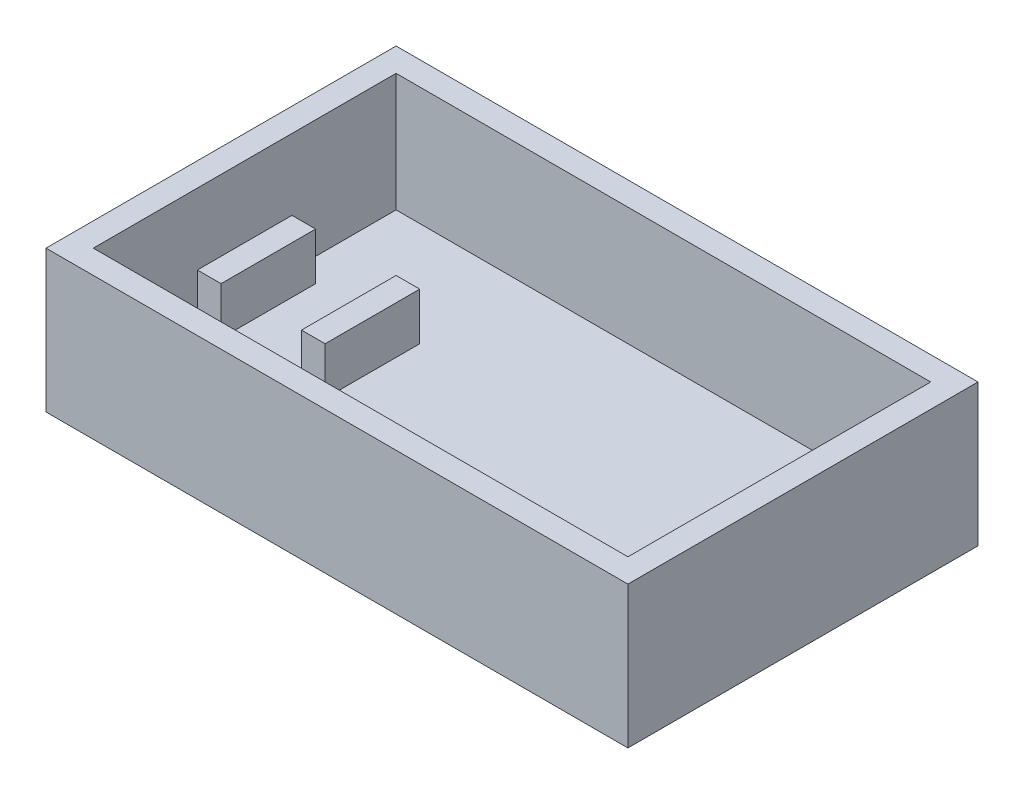
ISO-10303-21;
HEADER;
FILE_DESCRIPTION(('STEP AP214'),'2;1');
FILE_NAME('part.step','',(''),(''),'','','');
FILE_SCHEMA(('AUTOMOTIVE_DESIGN { 1 0 10303 214 1 1 1 1 }'));
ENDSEC;
DATA;
#1=APPLICATION_CONTEXT('core data for automotive mechanical design processes');
#2=APPLICATION_PROTOCOL_DEFINITION('international standard','automotive_design',2000,#1);
#3=PRODUCT_CONTEXT('',#1,'mechanical');
#4=PRODUCT('Part','Part','',(#3));
#5=PRODUCT_RELATED_PRODUCT_CATEGORY('part','',(#4));
#6=PRODUCT_DEFINITION_FORMATION('','',#4);
#7=PRODUCT_DEFINITION_CONTEXT('part definition',#1,'design');
#8=PRODUCT_DEFINITION('design','',#6,#7);
#9=PRODUCT_DEFINITION_SHAPE('','',#8);
#10=(LENGTH_UNIT() NAMED_UNIT(*) SI_UNIT(.MILLI.,.METRE.));
#11=(NAMED_UNIT(*) PLANE_ANGLE_UNIT() SI_UNIT($,.RADIAN.));
#12=(NAMED_UNIT(*) SI_UNIT($,.STERADIAN.) SOLID_ANGLE_UNIT());
#13=UNCERTAINTY_MEASURE_WITH_UNIT(LENGTH_MEASURE(1.E-05),#10,'distance_accuracy_value','');
#14=(GEOMETRIC_REPRESENTATION_CONTEXT(3) GLOBAL_UNCERTAINTY_ASSIGNED_CONTEXT((#13)) GLOBAL_UNIT_ASSIGNED_CONTEXT((#10,
#11,#12)) REPRESENTATION_CONTEXT('',''));
#15=CARTESIAN_POINT('',(0.,0.,0.));
#16=DIRECTION('',(0.,0.,1.));
#17=DIRECTION('',(1.,0.,0.));
#18=AXIS2_PLACEMENT_3D('',#15,#16,#17);
#19=CARTESIAN_POINT('',(0.,5.,0.));
#20=DIRECTION('',(0.,1.,0.));
#21=DIRECTION('',(0.,0.,1.));
#22=AXIS2_PLACEMENT_3D('',#19,#20,#21);
#23=PLANE('',#22);
#24=DIRECTION('',(0.,0.,1.));
#25=VECTOR('',#24,1.);
#26=CARTESIAN_POINT('',(-56.5,5.,-32.));
#27=LINE('',#26,#25);
#28=CARTESIAN_POINT('',(-56.5,5.,-32.));
#29=VERTEX_POINT('',#28);
#30=CARTESIAN_POINT('',(-56.5,5.,-9.99999999999998));
#31=VERTEX_POINT('',#30);
#32=EDGE_CURVE('E216',#29,#31,#27,.T.);
#33=ORIENTED_EDGE('',*,*,#32,.T.);
#34=DIRECTION('',(-1.,0.,0.));
#35=VECTOR('',#34,1.);
#36=CARTESIAN_POINT('',(0.,5.,-9.99999999999998));
#37=LINE('',#36,#35);
#38=CARTESIAN_POINT('',(-51.5,5.,-9.99999999999998));
#39=VERTEX_POINT('',#38);
#40=EDGE_CURVE('E174',#39,#31,#37,.T.);
#41=ORIENTED_EDGE('',*,*,#40,.F.);
#42=DIRECTION('',(0.,0.,-1.));
#43=VECTOR('',#42,1.);
#44=CARTESIAN_POINT('',(-51.5,5.,0.));
#45=LINE('',#44,#43);
#46=CARTESIAN_POINT('',(-51.5,5.,10.));
#47=VERTEX_POINT('',#46);
#48=EDGE_CURVE('E171',#47,#39,#45,.T.);
#49=ORIENTED_EDGE('',*,*,#48,.F.);
#50=DIRECTION('',(-1.,0.,0.));
#51=VECTOR('',#50,1.);
#52=CARTESIAN_POINT('',(0.,5.,10.));
#53=LINE('',#52,#51);
#54=CARTESIAN_POINT('',(-56.5,5.,10.));
#55=VERTEX_POINT('',#54);
#56=EDGE_CURVE('E184',#47,#55,#53,.T.);
#57=ORIENTED_EDGE('',*,*,#56,.T.);
#58=CARTESIAN_POINT('',(-56.5,5.,32.));
#59=VERTEX_POINT('',#58);
#60=EDGE_CURVE('E215',#55,#59,#27,.T.);
#61=ORIENTED_EDGE('',*,*,#60,.T.);
#62=DIRECTION('',(1.,0.,0.));
#63=VECTOR('',#62,1.);
#64=CARTESIAN_POINT('',(-56.5,5.,32.));
#65=LINE('',#64,#63);
#66=CARTESIAN_POINT('',(56.5,5.,32.));
#67=VERTEX_POINT('',#66);
#68=EDGE_CURVE('E219',#59,#67,#65,.T.);
#69=ORIENTED_EDGE('',*,*,#68,.T.);
#70=DIRECTION('',(0.,0.,-1.));
#71=VECTOR('',#70,1.);
#72=CARTESIAN_POINT('',(56.5,5.,-32.));
#73=LINE('',#72,#71);
#74=CARTESIAN_POINT('',(56.5,5.,-32.));
#75=VERTEX_POINT('',#74);
#76=EDGE_CURVE('E208',#67,#75,#73,.T.);
#77=ORIENTED_EDGE('',*,*,#76,.T.);
#78=DIRECTION('',(-1.,0.,0.));
#79=VECTOR('',#78,1.);
#80=CARTESIAN_POINT('',(-56.5,5.,-32.));
#81=LINE('',#80,#79);
#82=EDGE_CURVE('E211',#75,#29,#81,.T.);
#83=ORIENTED_EDGE('',*,*,#82,.T.);
#84=EDGE_LOOP('',(#33,#41,#49,#57,#61,#69,#77,#83));
#85=FACE_BOUND('',#84,.T.);
#86=DIRECTION('',(-1.,0.,0.));
#87=VECTOR('',#86,1.);
#88=CARTESIAN_POINT('',(22.,5.,-9.99999999999998));
#89=LINE('',#88,#87);
#90=CARTESIAN_POINT('',(-29.5,5.,-9.99999999999998));
#91=VERTEX_POINT('',#90);
#92=CARTESIAN_POINT('',(-34.5,5.,-9.99999999999998));
#93=VERTEX_POINT('',#92);
#94=EDGE_CURVE('E52',#91,#93,#89,.T.);
#95=ORIENTED_EDGE('',*,*,#94,.F.);
#96=DIRECTION('',(0.,0.,-1.));
#97=VECTOR('',#96,1.);
#98=CARTESIAN_POINT('',(-29.5,5.,0.));
#99=LINE('',#98,#97);
#100=CARTESIAN_POINT('',(-29.5,5.,10.));
#101=VERTEX_POINT('',#100);
#102=EDGE_CURVE('E170',#101,#91,#99,.T.);
#103=ORIENTED_EDGE('',*,*,#102,.F.);
#104=DIRECTION('',(-1.,0.,0.));
#105=VECTOR('',#104,1.);
#106=CARTESIAN_POINT('',(22.,5.,10.));
#107=LINE('',#106,#105);
#108=CARTESIAN_POINT('',(-34.5,5.,10.));
#109=VERTEX_POINT('',#108);
#110=EDGE_CURVE('E167',#101,#109,#107,.T.);
#111=ORIENTED_EDGE('',*,*,#110,.T.);
#112=DIRECTION('',(0.,0.,1.));
#113=VECTOR('',#112,1.);
#114=CARTESIAN_POINT('',(-34.5,5.,0.));
#115=LINE('',#114,#113);
#116=EDGE_CURVE('E57',#93,#109,#115,.T.);
#117=ORIENTED_EDGE('',*,*,#116,.F.);
#118=EDGE_LOOP('',(#95,#103,#111,#117));
#119=FACE_BOUND('',#118,.T.);
#120=ADVANCED_FACE('F37',(#85,#119),#23,.T.);
#121=CARTESIAN_POINT('',(-56.5,5.,-32.));
#122=DIRECTION('',(-1.,0.,0.));
#123=DIRECTION('',(0.,0.,1.));
#124=AXIS2_PLACEMENT_3D('',#121,#122,#123);
#125=PLANE('',#124);
#126=DIRECTION('',(0.,-1.,0.));
#127=VECTOR('',#126,1.);
#128=CARTESIAN_POINT('',(-56.5,15.,-9.99999999999998));
#129=LINE('',#128,#127);
#130=CARTESIAN_POINT('',(-56.5,15.,-9.99999999999997));
#131=VERTEX_POINT('',#130);
#132=EDGE_CURVE('E202',#131,#31,#129,.T.);
#133=ORIENTED_EDGE('',*,*,#132,.T.);
#134=ORIENTED_EDGE('',*,*,#32,.F.);
#135=DIRECTION('',(0.,1.,0.));
#136=VECTOR('',#135,1.);
#137=CARTESIAN_POINT('',(-56.5,5.,-32.));
#138=LINE('',#137,#136);
#139=CARTESIAN_POINT('',(-56.5,30.,-32.));
#140=VERTEX_POINT('',#139);
#141=EDGE_CURVE('E237',#29,#140,#138,.T.);
#142=ORIENTED_EDGE('',*,*,#141,.T.);
#143=DIRECTION('',(0.,0.,1.));
#144=VECTOR('',#143,1.);
#145=CARTESIAN_POINT('',(-56.5,30.,-32.));
#146=LINE('',#145,#144);
#147=CARTESIAN_POINT('',(-56.5,30.,32.));
#148=VERTEX_POINT('',#147);
#149=EDGE_CURVE('E227',#140,#148,#146,.T.);
#150=ORIENTED_EDGE('',*,*,#149,.T.);
#151=DIRECTION('',(0.,1.,0.));
#152=VECTOR('',#151,1.);
#153=CARTESIAN_POINT('',(-56.5,5.,32.));
#154=LINE('',#153,#152);
#155=EDGE_CURVE('E235',#59,#148,#154,.T.);
#156=ORIENTED_EDGE('',*,*,#155,.F.);
#157=ORIENTED_EDGE('',*,*,#60,.F.);
#158=DIRECTION('',(0.,-1.,0.));
#159=VECTOR('',#158,1.);
#160=CARTESIAN_POINT('',(-56.5,15.,10.));
#161=LINE('',#160,#159);
#162=CARTESIAN_POINT('',(-56.5,15.,10.));
#163=VERTEX_POINT('',#162);
#164=EDGE_CURVE('E199',#163,#55,#161,.T.);
#165=ORIENTED_EDGE('',*,*,#164,.F.);
#166=DIRECTION('',(0.,0.,1.));
#167=VECTOR('',#166,1.);
#168=CARTESIAN_POINT('',(-56.5,15.,0.));
#169=LINE('',#168,#167);
#170=EDGE_CURVE('E187',#131,#163,#169,.T.);
#171=ORIENTED_EDGE('',*,*,#170,.F.);
#172=EDGE_LOOP('',(#133,#134,#142,#150,#156,#157,#165,#171));
#173=FACE_BOUND('',#172,.T.);
#174=ADVANCED_FACE('F291',(#173),#125,.F.);
#175=CARTESIAN_POINT('',(61.5,30.,-37.));
#176=DIRECTION('',(-1.,0.,0.));
#177=DIRECTION('',(0.,0.,1.));
#178=AXIS2_PLACEMENT_3D('',#175,#176,#177);
#179=PLANE('',#178);
#180=DIRECTION('',(0.,0.,-1.));
#181=VECTOR('',#180,1.);
#182=CARTESIAN_POINT('',(61.5,0.,-37.));
#183=LINE('',#182,#181);
#184=CARTESIAN_POINT('',(61.5,0.,37.));
#185=VERTEX_POINT('',#184);
#186=CARTESIAN_POINT('',(61.5,0.,-37.));
#187=VERTEX_POINT('',#186);
#188=EDGE_CURVE('E234',#185,#187,#183,.T.);
#189=ORIENTED_EDGE('',*,*,#188,.T.);
#190=DIRECTION('',(0.,-1.,0.));
#191=VECTOR('',#190,1.);
#192=CARTESIAN_POINT('',(61.5,30.,-37.));
#193=LINE('',#192,#191);
#194=CARTESIAN_POINT('',(61.5,30.,-37.));
#195=VERTEX_POINT('',#194);
#196=EDGE_CURVE('E11',#195,#187,#193,.T.);
#197=ORIENTED_EDGE('',*,*,#196,.F.);
#198=DIRECTION('',(0.,0.,-1.));
#199=VECTOR('',#198,1.);
#200=CARTESIAN_POINT('',(61.5,30.,-37.));
#201=LINE('',#200,#199);
#202=CARTESIAN_POINT('',(61.5,30.,37.));
#203=VERTEX_POINT('',#202);
#204=EDGE_CURVE('E241',#203,#195,#201,.T.);
#205=ORIENTED_EDGE('',*,*,#204,.F.);
#206=DIRECTION('',(0.,-1.,0.));
#207=VECTOR('',#206,1.);
#208=CARTESIAN_POINT('',(61.5,30.,37.));
#209=LINE('',#208,#207);
#210=EDGE_CURVE('E251',#203,#185,#209,.T.);
#211=ORIENTED_EDGE('',*,*,#210,.T.);
#212=EDGE_LOOP('',(#189,#197,#205,#211));
#213=FACE_BOUND('',#212,.T.);
#214=ADVANCED_FACE('F39',(#213),#179,.F.);
#215=CARTESIAN_POINT('',(-61.5,30.,-37.));
#216=DIRECTION('',(0.,0.,1.));
#217=DIRECTION('',(1.,0.,0.));
#218=AXIS2_PLACEMENT_3D('',#215,#216,#217);
#219=PLANE('',#218);
#220=DIRECTION('',(-1.,0.,0.));
#221=VECTOR('',#220,1.);
#222=CARTESIAN_POINT('',(-61.5,0.,-37.));
#223=LINE('',#222,#221);
#224=CARTESIAN_POINT('',(-61.5,0.,-37.));
#225=VERTEX_POINT('',#224);
#226=EDGE_CURVE('E254',#187,#225,#223,.T.);
#227=ORIENTED_EDGE('',*,*,#226,.T.);
#228=DIRECTION('',(0.,-1.,0.));
#229=VECTOR('',#228,1.);
#230=CARTESIAN_POINT('',(-61.5,30.,-37.));
#231=LINE('',#230,#229);
#232=CARTESIAN_POINT('',(-61.5,30.,-37.));
#233=VERTEX_POINT('',#232);
#234=EDGE_CURVE('E45',#233,#225,#231,.T.);
#235=ORIENTED_EDGE('',*,*,#234,.F.);
#236=DIRECTION('',(-1.,0.,0.));
#237=VECTOR('',#236,1.);
#238=CARTESIAN_POINT('',(-61.5,30.,-37.));
#239=LINE('',#238,#237);
#240=EDGE_CURVE('E244',#195,#233,#239,.T.);
#241=ORIENTED_EDGE('',*,*,#240,.F.);
#242=ORIENTED_EDGE('',*,*,#196,.T.);
#243=EDGE_LOOP('',(#227,#235,#241,#242));
#244=FACE_BOUND('',#243,.T.);
#245=ADVANCED_FACE('F284',(#244),#219,.F.);
#246=CARTESIAN_POINT('',(-61.5,30.,-37.));
#247=DIRECTION('',(1.,0.,0.));
#248=DIRECTION('',(0.,0.,-1.));
#249=AXIS2_PLACEMENT_3D('',#246,#247,#248);
#250=PLANE('',#249);
#251=DIRECTION('',(0.,0.,1.));
#252=VECTOR('',#251,1.);
#253=CARTESIAN_POINT('',(-61.5,0.,-37.));
#254=LINE('',#253,#252);
#255=CARTESIAN_POINT('',(-61.5,0.,37.));
#256=VERTEX_POINT('',#255);
#257=EDGE_CURVE('E256',#225,#256,#254,.T.);
#258=ORIENTED_EDGE('',*,*,#257,.T.);
#259=DIRECTION('',(0.,-1.,0.));
#260=VECTOR('',#259,1.);
#261=CARTESIAN_POINT('',(-61.5,30.,37.));
#262=LINE('',#261,#260);
#263=CARTESIAN_POINT('',(-61.5,30.,37.));
#264=VERTEX_POINT('',#263);
#265=EDGE_CURVE('E261',#264,#256,#262,.T.);
#266=ORIENTED_EDGE('',*,*,#265,.F.);
#267=DIRECTION('',(0.,0.,1.));
#268=VECTOR('',#267,1.);
#269=CARTESIAN_POINT('',(-61.5,30.,-37.));
#270=LINE('',#269,#268);
#271=EDGE_CURVE('E247',#233,#264,#270,.T.);
#272=ORIENTED_EDGE('',*,*,#271,.F.);
#273=ORIENTED_EDGE('',*,*,#234,.T.);
#274=EDGE_LOOP('',(#258,#266,#272,#273));
#275=FACE_BOUND('',#274,.T.);
#276=ADVANCED_FACE('F268',(#275),#250,.F.);
#277=CARTESIAN_POINT('',(-61.5,30.,37.));
#278=DIRECTION('',(0.,0.,-1.));
#279=DIRECTION('',(-1.,0.,0.));
#280=AXIS2_PLACEMENT_3D('',#277,#278,#279);
#281=PLANE('',#280);
#282=DIRECTION('',(1.,0.,0.));
#283=VECTOR('',#282,1.);
#284=CARTESIAN_POINT('',(-61.5,0.,37.));
#285=LINE('',#284,#283);
#286=EDGE_CURVE('E245',#256,#185,#285,.T.);
#287=ORIENTED_EDGE('',*,*,#286,.T.);
#288=ORIENTED_EDGE('',*,*,#210,.F.);
#289=DIRECTION('',(1.,0.,0.));
#290=VECTOR('',#289,1.);
#291=CARTESIAN_POINT('',(-61.5,30.,37.));
#292=LINE('',#291,#290);
#293=EDGE_CURVE('E249',#264,#203,#292,.T.);
#294=ORIENTED_EDGE('',*,*,#293,.F.);
#295=ORIENTED_EDGE('',*,*,#265,.T.);
#296=EDGE_LOOP('',(#287,#288,#294,#295));
#297=FACE_BOUND('',#296,.T.);
#298=ADVANCED_FACE('F277',(#297),#281,.F.);
#299=CARTESIAN_POINT('',(0.,30.,0.));
#300=DIRECTION('',(0.,1.,0.));
#301=DIRECTION('',(0.,0.,1.));
#302=AXIS2_PLACEMENT_3D('',#299,#300,#301);
#303=PLANE('',#302);
#304=DIRECTION('',(0.,0.,-1.));
#305=VECTOR('',#304,1.);
#306=CARTESIAN_POINT('',(56.5,30.,-32.));
#307=LINE('',#306,#305);
#308=CARTESIAN_POINT('',(56.5,30.,32.));
#309=VERTEX_POINT('',#308);
#310=CARTESIAN_POINT('',(56.5,30.,-32.));
#311=VERTEX_POINT('',#310);
#312=EDGE_CURVE('E207',#309,#311,#307,.T.);
#313=ORIENTED_EDGE('',*,*,#312,.F.);
#314=DIRECTION('',(1.,0.,0.));
#315=VECTOR('',#314,1.);
#316=CARTESIAN_POINT('',(-56.5,30.,32.));
#317=LINE('',#316,#315);
#318=EDGE_CURVE('E212',#148,#309,#317,.T.);
#319=ORIENTED_EDGE('',*,*,#318,.F.);
#320=ORIENTED_EDGE('',*,*,#149,.F.);
#321=DIRECTION('',(-1.,0.,0.));
#322=VECTOR('',#321,1.);
#323=CARTESIAN_POINT('',(-56.5,30.,-32.));
#324=LINE('',#323,#322);
#325=EDGE_CURVE('E224',#311,#140,#324,.T.);
#326=ORIENTED_EDGE('',*,*,#325,.F.);
#327=EDGE_LOOP('',(#313,#319,#320,#326));
#328=FACE_BOUND('',#327,.T.);
#329=ORIENTED_EDGE('',*,*,#204,.T.);
#330=ORIENTED_EDGE('',*,*,#240,.T.);
#331=ORIENTED_EDGE('',*,*,#271,.T.);
#332=ORIENTED_EDGE('',*,*,#293,.T.);
#333=EDGE_LOOP('',(#329,#330,#331,#332));
#334=FACE_BOUND('',#333,.T.);
#335=ADVANCED_FACE('F283',(#328,#334),#303,.T.);
#336=CARTESIAN_POINT('',(0.,0.,0.));
#337=DIRECTION('',(0.,1.,0.));
#338=DIRECTION('',(0.,0.,1.));
#339=AXIS2_PLACEMENT_3D('',#336,#337,#338);
#340=PLANE('',#339);
#341=ORIENTED_EDGE('',*,*,#188,.F.);
#342=ORIENTED_EDGE('',*,*,#286,.F.);
#343=ORIENTED_EDGE('',*,*,#257,.F.);
#344=ORIENTED_EDGE('',*,*,#226,.F.);
#345=EDGE_LOOP('',(#341,#342,#343,#344));
#346=FACE_BOUND('',#345,.T.);
#347=ADVANCED_FACE('F274',(#346),#340,.F.);
#348=CARTESIAN_POINT('',(56.5,5.,-32.));
#349=DIRECTION('',(1.,0.,0.));
#350=DIRECTION('',(0.,0.,-1.));
#351=AXIS2_PLACEMENT_3D('',#348,#349,#350);
#352=PLANE('',#351);
#353=ORIENTED_EDGE('',*,*,#312,.T.);
#354=DIRECTION('',(0.,1.,0.));
#355=VECTOR('',#354,1.);
#356=CARTESIAN_POINT('',(56.5,5.,-32.));
#357=LINE('',#356,#355);
#358=EDGE_CURVE('E222',#75,#311,#357,.T.);
#359=ORIENTED_EDGE('',*,*,#358,.F.);
#360=ORIENTED_EDGE('',*,*,#76,.F.);
#361=DIRECTION('',(0.,1.,0.));
#362=VECTOR('',#361,1.);
#363=CARTESIAN_POINT('',(56.5,5.,32.));
#364=LINE('',#363,#362);
#365=EDGE_CURVE('E232',#67,#309,#364,.T.);
#366=ORIENTED_EDGE('',*,*,#365,.T.);
#367=EDGE_LOOP('',(#353,#359,#360,#366));
#368=FACE_BOUND('',#367,.T.);
#369=ADVANCED_FACE('F307',(#368),#352,.F.);
#370=CARTESIAN_POINT('',(-56.5,5.,32.));
#371=DIRECTION('',(0.,0.,1.));
#372=DIRECTION('',(1.,0.,0.));
#373=AXIS2_PLACEMENT_3D('',#370,#371,#372);
#374=PLANE('',#373);
#375=ORIENTED_EDGE('',*,*,#318,.T.);
#376=ORIENTED_EDGE('',*,*,#365,.F.);
#377=ORIENTED_EDGE('',*,*,#68,.F.);
#378=ORIENTED_EDGE('',*,*,#155,.T.);
#379=EDGE_LOOP('',(#375,#376,#377,#378));
#380=FACE_BOUND('',#379,.T.);
#381=ADVANCED_FACE('F304',(#380),#374,.F.);
#382=CARTESIAN_POINT('',(-56.5,5.,-32.));
#383=DIRECTION('',(0.,0.,-1.));
#384=DIRECTION('',(-1.,0.,0.));
#385=AXIS2_PLACEMENT_3D('',#382,#383,#384);
#386=PLANE('',#385);
#387=ORIENTED_EDGE('',*,*,#325,.T.);
#388=ORIENTED_EDGE('',*,*,#141,.F.);
#389=ORIENTED_EDGE('',*,*,#82,.F.);
#390=ORIENTED_EDGE('',*,*,#358,.T.);
#391=EDGE_LOOP('',(#387,#388,#389,#390));
#392=FACE_BOUND('',#391,.T.);
#393=ADVANCED_FACE('F306',(#392),#386,.F.);
#394=CARTESIAN_POINT('',(-51.5,15.,0.));
#395=DIRECTION('',(-1.,0.,0.));
#396=DIRECTION('',(0.,0.,1.));
#397=AXIS2_PLACEMENT_3D('',#394,#395,#396);
#398=PLANE('',#397);
#399=ORIENTED_EDGE('',*,*,#48,.T.);
#400=DIRECTION('',(0.,-1.,0.));
#401=VECTOR('',#400,1.);
#402=CARTESIAN_POINT('',(-51.5,15.,-9.99999999999998));
#403=LINE('',#402,#401);
#404=CARTESIAN_POINT('',(-51.5,15.,-9.99999999999998));
#405=VERTEX_POINT('',#404);
#406=EDGE_CURVE('E204',#405,#39,#403,.T.);
#407=ORIENTED_EDGE('',*,*,#406,.F.);
#408=DIRECTION('',(0.,0.,-1.));
#409=VECTOR('',#408,1.);
#410=CARTESIAN_POINT('',(-51.5,15.,0.));
#411=LINE('',#410,#409);
#412=CARTESIAN_POINT('',(-51.5,15.,10.));
#413=VERTEX_POINT('',#412);
#414=EDGE_CURVE('E180',#413,#405,#411,.T.);
#415=ORIENTED_EDGE('',*,*,#414,.F.);
#416=DIRECTION('',(0.,-1.,0.));
#417=VECTOR('',#416,1.);
#418=CARTESIAN_POINT('',(-51.5,15.,10.));
#419=LINE('',#418,#417);
#420=EDGE_CURVE('E192',#413,#47,#419,.T.);
#421=ORIENTED_EDGE('',*,*,#420,.T.);
#422=EDGE_LOOP('',(#399,#407,#415,#421));
#423=FACE_BOUND('',#422,.T.);
#424=ADVANCED_FACE('F302',(#423),#398,.F.);
#425=CARTESIAN_POINT('',(0.,15.,-9.99999999999998));
#426=DIRECTION('',(0.,0.,1.));
#427=DIRECTION('',(1.,0.,0.));
#428=AXIS2_PLACEMENT_3D('',#425,#426,#427);
#429=PLANE('',#428);
#430=ORIENTED_EDGE('',*,*,#40,.T.);
#431=ORIENTED_EDGE('',*,*,#132,.F.);
#432=DIRECTION('',(-1.,0.,0.));
#433=VECTOR('',#432,1.);
#434=CARTESIAN_POINT('',(0.,15.,-9.99999999999998));
#435=LINE('',#434,#433);
#436=EDGE_CURVE('E183',#405,#131,#435,.T.);
#437=ORIENTED_EDGE('',*,*,#436,.F.);
#438=ORIENTED_EDGE('',*,*,#406,.T.);
#439=EDGE_LOOP('',(#430,#431,#437,#438));
#440=FACE_BOUND('',#439,.T.);
#441=ADVANCED_FACE('F353',(#440),#429,.F.);
#442=CARTESIAN_POINT('',(0.,15.,10.));
#443=DIRECTION('',(0.,0.,1.));
#444=DIRECTION('',(1.,0.,0.));
#445=AXIS2_PLACEMENT_3D('',#442,#443,#444);
#446=PLANE('',#445);
#447=ORIENTED_EDGE('',*,*,#56,.F.);
#448=ORIENTED_EDGE('',*,*,#420,.F.);
#449=DIRECTION('',(-1.,0.,0.));
#450=VECTOR('',#449,1.);
#451=CARTESIAN_POINT('',(0.,15.,10.));
#452=LINE('',#451,#450);
#453=EDGE_CURVE('E190',#413,#163,#452,.T.);
#454=ORIENTED_EDGE('',*,*,#453,.T.);
#455=ORIENTED_EDGE('',*,*,#164,.T.);
#456=EDGE_LOOP('',(#447,#448,#454,#455));
#457=FACE_BOUND('',#456,.T.);
#458=ADVANCED_FACE('F360',(#457),#446,.T.);
#459=CARTESIAN_POINT('',(0.,15.,0.));
#460=DIRECTION('',(0.,1.,0.));
#461=DIRECTION('',(0.,0.,1.));
#462=AXIS2_PLACEMENT_3D('',#459,#460,#461);
#463=PLANE('',#462);
#464=ORIENTED_EDGE('',*,*,#414,.T.);
#465=ORIENTED_EDGE('',*,*,#436,.T.);
#466=ORIENTED_EDGE('',*,*,#170,.T.);
#467=ORIENTED_EDGE('',*,*,#453,.F.);
#468=EDGE_LOOP('',(#464,#465,#466,#467));
#469=FACE_BOUND('',#468,.T.);
#470=ADVANCED_FACE('F367',(#469),#463,.T.);
#471=CARTESIAN_POINT('',(-29.5,15.,0.));
#472=DIRECTION('',(-1.,0.,0.));
#473=DIRECTION('',(0.,0.,1.));
#474=AXIS2_PLACEMENT_3D('',#471,#472,#473);
#475=PLANE('',#474);
#476=ORIENTED_EDGE('',*,*,#102,.T.);
#477=DIRECTION('',(0.,-1.,0.));
#478=VECTOR('',#477,1.);
#479=CARTESIAN_POINT('',(-29.5,15.,-9.99999999999998));
#480=LINE('',#479,#478);
#481=CARTESIAN_POINT('',(-29.5,15.,-9.99999999999998));
#482=VERTEX_POINT('',#481);
#483=EDGE_CURVE('E151',#482,#91,#480,.T.);
#484=ORIENTED_EDGE('',*,*,#483,.F.);
#485=DIRECTION('',(0.,0.,-1.));
#486=VECTOR('',#485,1.);
#487=CARTESIAN_POINT('',(-29.5,15.,0.));
#488=LINE('',#487,#486);
#489=CARTESIAN_POINT('',(-29.5,15.,10.));
#490=VERTEX_POINT('',#489);
#491=EDGE_CURVE('E158',#490,#482,#488,.T.);
#492=ORIENTED_EDGE('',*,*,#491,.F.);
#493=DIRECTION('',(0.,-1.,0.));
#494=VECTOR('',#493,1.);
#495=CARTESIAN_POINT('',(-29.5,15.,10.));
#496=LINE('',#495,#494);
#497=EDGE_CURVE('E470',#490,#101,#496,.T.);
#498=ORIENTED_EDGE('',*,*,#497,.T.);
#499=EDGE_LOOP('',(#476,#484,#492,#498));
#500=FACE_BOUND('',#499,.T.);
#501=ADVANCED_FACE('F169',(#500),#475,.F.);
#502=CARTESIAN_POINT('',(22.,15.,-9.99999999999998));
#503=DIRECTION('',(0.,0.,1.));
#504=DIRECTION('',(1.,0.,0.));
#505=AXIS2_PLACEMENT_3D('',#502,#503,#504);
#506=PLANE('',#505);
#507=ORIENTED_EDGE('',*,*,#94,.T.);
#508=DIRECTION('',(0.,-1.,0.));
#509=VECTOR('',#508,1.);
#510=CARTESIAN_POINT('',(-34.5,15.,-9.99999999999998));
#511=LINE('',#510,#509);
#512=CARTESIAN_POINT('',(-34.5,15.,-9.99999999999998));
#513=VERTEX_POINT('',#512);
#514=EDGE_CURVE('E154',#513,#93,#511,.T.);
#515=ORIENTED_EDGE('',*,*,#514,.F.);
#516=DIRECTION('',(-1.,0.,0.));
#517=VECTOR('',#516,1.);
#518=CARTESIAN_POINT('',(22.,15.,-9.99999999999998));
#519=LINE('',#518,#517);
#520=EDGE_CURVE('E147',#482,#513,#519,.T.);
#521=ORIENTED_EDGE('',*,*,#520,.F.);
#522=ORIENTED_EDGE('',*,*,#483,.T.);
#523=EDGE_LOOP('',(#507,#515,#521,#522));
#524=FACE_BOUND('',#523,.T.);
#525=ADVANCED_FACE('F149',(#524),#506,.F.);
#526=CARTESIAN_POINT('',(-34.5,15.,0.));
#527=DIRECTION('',(1.,0.,0.));
#528=DIRECTION('',(0.,0.,-1.));
#529=AXIS2_PLACEMENT_3D('',#526,#527,#528);
#530=PLANE('',#529);
#531=ORIENTED_EDGE('',*,*,#116,.T.);
#532=DIRECTION('',(0.,-1.,0.));
#533=VECTOR('',#532,1.);
#534=CARTESIAN_POINT('',(-34.5,15.,10.));
#535=LINE('',#534,#533);
#536=CARTESIAN_POINT('',(-34.5,15.,10.));
#537=VERTEX_POINT('',#536);
#538=EDGE_CURVE('E176',#537,#109,#535,.T.);
#539=ORIENTED_EDGE('',*,*,#538,.F.);
#540=DIRECTION('',(0.,0.,1.));
#541=VECTOR('',#540,1.);
#542=CARTESIAN_POINT('',(-34.5,15.,0.));
#543=LINE('',#542,#541);
#544=EDGE_CURVE('E157',#513,#537,#543,.T.);
#545=ORIENTED_EDGE('',*,*,#544,.F.);
#546=ORIENTED_EDGE('',*,*,#514,.T.);
#547=EDGE_LOOP('',(#531,#539,#545,#546));
#548=FACE_BOUND('',#547,.T.);
#549=ADVANCED_FACE('F388',(#548),#530,.F.);
#550=CARTESIAN_POINT('',(22.,15.,10.));
#551=DIRECTION('',(0.,0.,1.));
#552=DIRECTION('',(1.,0.,0.));
#553=AXIS2_PLACEMENT_3D('',#550,#551,#552);
#554=PLANE('',#553);
#555=ORIENTED_EDGE('',*,*,#110,.F.);
#556=ORIENTED_EDGE('',*,*,#497,.F.);
#557=DIRECTION('',(-1.,0.,0.));
#558=VECTOR('',#557,1.);
#559=CARTESIAN_POINT('',(22.,15.,10.));
#560=LINE('',#559,#558);
#561=EDGE_CURVE('E164',#490,#537,#560,.T.);
#562=ORIENTED_EDGE('',*,*,#561,.T.);
#563=ORIENTED_EDGE('',*,*,#538,.T.);
#564=EDGE_LOOP('',(#555,#556,#562,#563));
#565=FACE_BOUND('',#564,.T.);
#566=ADVANCED_FACE('F395',(#565),#554,.T.);
#567=CARTESIAN_POINT('',(22.,15.,0.));
#568=DIRECTION('',(0.,1.,0.));
#569=DIRECTION('',(0.,0.,1.));
#570=AXIS2_PLACEMENT_3D('',#567,#568,#569);
#571=PLANE('',#570);
#572=ORIENTED_EDGE('',*,*,#491,.T.);
#573=ORIENTED_EDGE('',*,*,#520,.T.);
#574=ORIENTED_EDGE('',*,*,#544,.T.);
#575=ORIENTED_EDGE('',*,*,#561,.F.);
#576=EDGE_LOOP('',(#572,#573,#574,#575));
#577=FACE_BOUND('',#576,.T.);
#578=ADVANCED_FACE('F162',(#577),#571,.T.);
#579=CLOSED_SHELL('',(#120,#174,#214,#245,#276,#298,#335,#347,#369,#381,#393,#424,#441,#458,
#470,#501,#525,#549,#566,#578));
#580=MANIFOLD_SOLID_BREP('B2',#579);
#581=ADVANCED_BREP_SHAPE_REPRESENTATION('',(#18,#580),#14);
#582=SHAPE_DEFINITION_REPRESENTATION(#9,#581);
ENDSEC;
END-ISO-10303-21;
